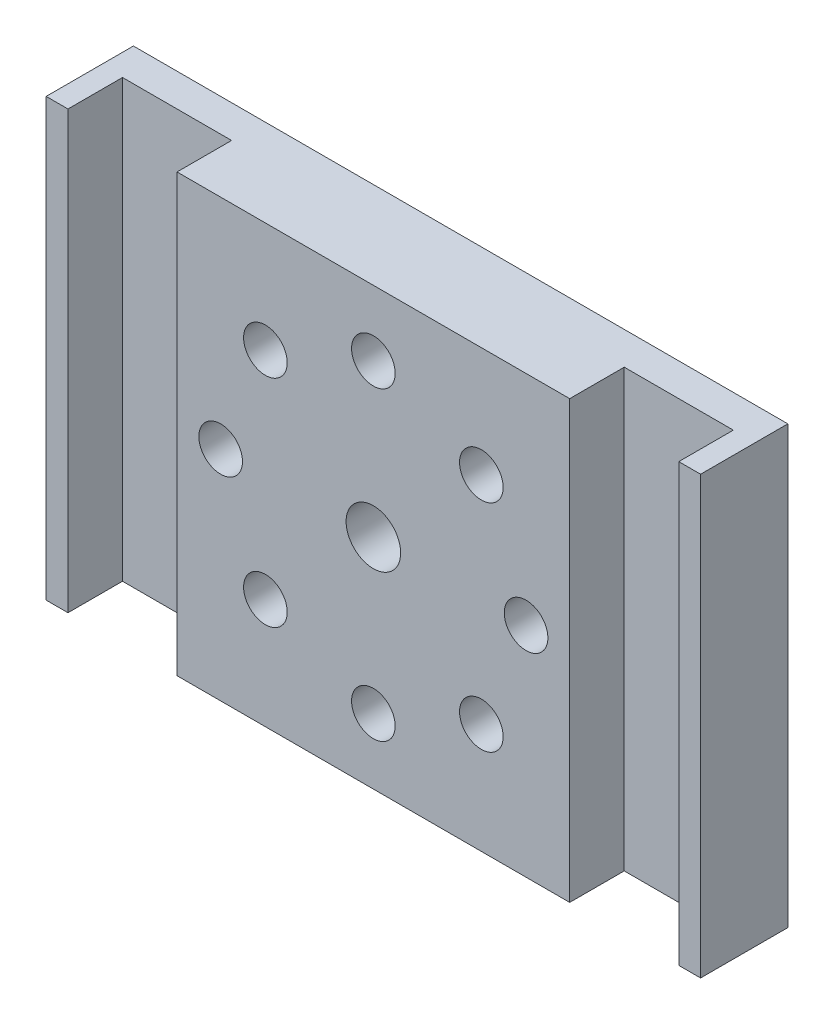
ISO-10303-21;
HEADER;
FILE_DESCRIPTION(('STEP AP214'),'2;1');
FILE_NAME('part.step','',(''),(''),'','','');
FILE_SCHEMA(('AUTOMOTIVE_DESIGN { 1 0 10303 214 1 1 1 1 }'));
ENDSEC;
DATA;
#1=APPLICATION_CONTEXT('core data for automotive mechanical design processes');
#2=APPLICATION_PROTOCOL_DEFINITION('international standard','automotive_design',2000,#1);
#3=PRODUCT_CONTEXT('',#1,'mechanical');
#4=PRODUCT('Part','Part','',(#3));
#5=PRODUCT_RELATED_PRODUCT_CATEGORY('part','',(#4));
#6=PRODUCT_DEFINITION_FORMATION('','',#4);
#7=PRODUCT_DEFINITION_CONTEXT('part definition',#1,'design');
#8=PRODUCT_DEFINITION('design','',#6,#7);
#9=PRODUCT_DEFINITION_SHAPE('','',#8);
#10=(LENGTH_UNIT() NAMED_UNIT(*) SI_UNIT(.MILLI.,.METRE.));
#11=(NAMED_UNIT(*) PLANE_ANGLE_UNIT() SI_UNIT($,.RADIAN.));
#12=(NAMED_UNIT(*) SI_UNIT($,.STERADIAN.) SOLID_ANGLE_UNIT());
#13=UNCERTAINTY_MEASURE_WITH_UNIT(LENGTH_MEASURE(1.E-05),#10,'distance_accuracy_value','');
#14=(GEOMETRIC_REPRESENTATION_CONTEXT(3) GLOBAL_UNCERTAINTY_ASSIGNED_CONTEXT((#13)) GLOBAL_UNIT_ASSIGNED_CONTEXT((#10,
#11,#12)) REPRESENTATION_CONTEXT('',''));
#15=CARTESIAN_POINT('',(0.,0.,0.));
#16=DIRECTION('',(0.,0.,1.));
#17=DIRECTION('',(1.,0.,0.));
#18=AXIS2_PLACEMENT_3D('',#15,#16,#17);
#19=CARTESIAN_POINT('',(-30.,-20.,8.));
#20=DIRECTION('',(0.,0.,-1.));
#21=DIRECTION('',(-1.,0.,0.));
#22=AXIS2_PLACEMENT_3D('',#19,#20,#21);
#23=PLANE('',#22);
#24=CARTESIAN_POINT('',(-13.9999999999998,-2.04602083981807E-13,8.));
#25=DIRECTION('',(0.,0.,1.));
#26=DIRECTION('',(1.,0.,0.));
#27=AXIS2_PLACEMENT_3D('',#24,#25,#26);
#28=CIRCLE('',#27,2.00000000000039);
#29=CARTESIAN_POINT('',(-11.9999999999994,-2.04602083981807E-13,8.));
#30=VERTEX_POINT('',#29);
#31=EDGE_CURVE('E254',#30,#30,#28,.T.);
#32=ORIENTED_EDGE('',*,*,#31,.F.);
#33=EDGE_LOOP('',(#32));
#34=FACE_BOUND('',#33,.T.);
#35=CARTESIAN_POINT('',(3.98903336916386E-13,-14.,8.));
#36=DIRECTION('',(0.,0.,1.));
#37=DIRECTION('',(1.,0.,0.));
#38=AXIS2_PLACEMENT_3D('',#35,#36,#37);
#39=CIRCLE('',#38,2.00000000000047);
#40=CARTESIAN_POINT('',(2.00000000000087,-14.,8.));
#41=VERTEX_POINT('',#40);
#42=EDGE_CURVE('E266',#41,#41,#39,.T.);
#43=ORIENTED_EDGE('',*,*,#42,.F.);
#44=EDGE_LOOP('',(#43));
#45=FACE_BOUND('',#44,.T.);
#46=CARTESIAN_POINT('',(14.,0.,8.));
#47=DIRECTION('',(0.,0.,1.));
#48=DIRECTION('',(1.,0.,0.));
#49=AXIS2_PLACEMENT_3D('',#46,#47,#48);
#50=CIRCLE('',#49,2.);
#51=CARTESIAN_POINT('',(16.,0.,8.));
#52=VERTEX_POINT('',#51);
#53=EDGE_CURVE('E278',#52,#52,#50,.T.);
#54=ORIENTED_EDGE('',*,*,#53,.F.);
#55=EDGE_LOOP('',(#54));
#56=FACE_BOUND('',#55,.T.);
#57=CARTESIAN_POINT('',(0.,14.,8.));
#58=DIRECTION('',(0.,0.,1.));
#59=DIRECTION('',(1.,0.,0.));
#60=AXIS2_PLACEMENT_3D('',#57,#58,#59);
#61=CIRCLE('',#60,2.);
#62=CARTESIAN_POINT('',(2.,14.,8.));
#63=VERTEX_POINT('',#62);
#64=EDGE_CURVE('E290',#63,#63,#61,.T.);
#65=ORIENTED_EDGE('',*,*,#64,.F.);
#66=EDGE_LOOP('',(#65));
#67=FACE_BOUND('',#66,.T.);
#68=CARTESIAN_POINT('',(0.,0.,8.));
#69=DIRECTION('',(0.,0.,1.));
#70=DIRECTION('',(1.,0.,0.));
#71=AXIS2_PLACEMENT_3D('',#68,#69,#70);
#72=CIRCLE('',#71,2.5);
#73=CARTESIAN_POINT('',(2.5,0.,8.));
#74=VERTEX_POINT('',#73);
#75=EDGE_CURVE('E156',#74,#74,#72,.T.);
#76=ORIENTED_EDGE('',*,*,#75,.F.);
#77=EDGE_LOOP('',(#76));
#78=FACE_BOUND('',#77,.T.);
#79=CARTESIAN_POINT('',(9.89949493661168,9.89949493661165,8.));
#80=DIRECTION('',(0.,0.,1.));
#81=DIRECTION('',(1.,0.,0.));
#82=AXIS2_PLACEMENT_3D('',#79,#80,#81);
#83=CIRCLE('',#82,2.);
#84=CARTESIAN_POINT('',(11.8994949366117,9.89949493661165,8.));
#85=VERTEX_POINT('',#84);
#86=EDGE_CURVE('E284',#85,#85,#83,.T.);
#87=ORIENTED_EDGE('',*,*,#86,.F.);
#88=EDGE_LOOP('',(#87));
#89=FACE_BOUND('',#88,.T.);
#90=CARTESIAN_POINT('',(9.899494936612,-9.89949493661153,8.));
#91=DIRECTION('',(0.,0.,1.));
#92=DIRECTION('',(1.,0.,0.));
#93=AXIS2_PLACEMENT_3D('',#90,#91,#92);
#94=CIRCLE('',#93,2.00000000000035);
#95=CARTESIAN_POINT('',(11.8994949366124,-9.89949493661153,8.));
#96=VERTEX_POINT('',#95);
#97=EDGE_CURVE('E272',#96,#96,#94,.T.);
#98=ORIENTED_EDGE('',*,*,#97,.F.);
#99=EDGE_LOOP('',(#98));
#100=FACE_BOUND('',#99,.T.);
#101=CARTESIAN_POINT('',(-9.89949493661133,-9.89949493661181,8.));
#102=DIRECTION('',(0.,0.,1.));
#103=DIRECTION('',(1.,0.,0.));
#104=AXIS2_PLACEMENT_3D('',#101,#102,#103);
#105=CIRCLE('',#104,2.00000000000049);
#106=CARTESIAN_POINT('',(-7.89949493661084,-9.89949493661181,8.));
#107=VERTEX_POINT('',#106);
#108=EDGE_CURVE('E260',#107,#107,#105,.T.);
#109=ORIENTED_EDGE('',*,*,#108,.F.);
#110=EDGE_LOOP('',(#109));
#111=FACE_BOUND('',#110,.T.);
#112=CARTESIAN_POINT('',(-9.89949493661154,9.89949493661179,8.));
#113=DIRECTION('',(0.,0.,1.));
#114=DIRECTION('',(1.,0.,0.));
#115=AXIS2_PLACEMENT_3D('',#112,#113,#114);
#116=CIRCLE('',#115,2.);
#117=CARTESIAN_POINT('',(-7.89949493661155,9.89949493661179,8.));
#118=VERTEX_POINT('',#117);
#119=EDGE_CURVE('E247',#118,#118,#116,.T.);
#120=ORIENTED_EDGE('',*,*,#119,.F.);
#121=EDGE_LOOP('',(#120));
#122=FACE_BOUND('',#121,.T.);
#123=DIRECTION('',(1.,0.,0.));
#124=VECTOR('',#123,1.);
#125=CARTESIAN_POINT('',(30.,-20.,8.));
#126=LINE('',#125,#124);
#127=CARTESIAN_POINT('',(-18.,-20.,8.));
#128=VERTEX_POINT('',#127);
#129=CARTESIAN_POINT('',(18.,-20.,8.));
#130=VERTEX_POINT('',#129);
#131=EDGE_CURVE('E139',#128,#130,#126,.T.);
#132=ORIENTED_EDGE('',*,*,#131,.T.);
#133=DIRECTION('',(0.,1.,0.));
#134=VECTOR('',#133,1.);
#135=CARTESIAN_POINT('',(18.,-20.,8.));
#136=LINE('',#135,#134);
#137=CARTESIAN_POINT('',(18.,20.,8.));
#138=VERTEX_POINT('',#137);
#139=EDGE_CURVE('E124',#130,#138,#136,.T.);
#140=ORIENTED_EDGE('',*,*,#139,.T.);
#141=DIRECTION('',(-1.,0.,0.));
#142=VECTOR('',#141,1.);
#143=CARTESIAN_POINT('',(-30.,20.,8.));
#144=LINE('',#143,#142);
#145=CARTESIAN_POINT('',(-18.,20.,8.));
#146=VERTEX_POINT('',#145);
#147=EDGE_CURVE('E164',#138,#146,#144,.T.);
#148=ORIENTED_EDGE('',*,*,#147,.T.);
#149=DIRECTION('',(0.,1.,0.));
#150=VECTOR('',#149,1.);
#151=CARTESIAN_POINT('',(-18.,-20.,8.));
#152=LINE('',#151,#150);
#153=EDGE_CURVE('E147',#128,#146,#152,.T.);
#154=ORIENTED_EDGE('',*,*,#153,.F.);
#155=EDGE_LOOP('',(#132,#140,#148,#154));
#156=FACE_BOUND('',#155,.T.);
#157=ADVANCED_FACE('F33',(#34,#45,#56,#67,#78,#89,#100,#111,#122,#156),#23,.F.);
#158=CARTESIAN_POINT('',(30.,20.,8.));
#159=VERTEX_POINT('',#158);
#160=CARTESIAN_POINT('',(28.,20.,8.));
#161=VERTEX_POINT('',#160);
#162=EDGE_CURVE('E160',#159,#161,#144,.T.);
#163=ORIENTED_EDGE('',*,*,#162,.T.);
#164=DIRECTION('',(0.,1.,0.));
#165=VECTOR('',#164,1.);
#166=CARTESIAN_POINT('',(28.,-20.,8.));
#167=LINE('',#166,#165);
#168=CARTESIAN_POINT('',(28.,-20.,8.));
#169=VERTEX_POINT('',#168);
#170=EDGE_CURVE('E49',#169,#161,#167,.T.);
#171=ORIENTED_EDGE('',*,*,#170,.F.);
#172=CARTESIAN_POINT('',(30.,-20.,8.));
#173=VERTEX_POINT('',#172);
#174=EDGE_CURVE('E149',#169,#173,#126,.T.);
#175=ORIENTED_EDGE('',*,*,#174,.T.);
#176=DIRECTION('',(0.,1.,0.));
#177=VECTOR('',#176,1.);
#178=CARTESIAN_POINT('',(30.,20.,8.));
#179=LINE('',#178,#177);
#180=EDGE_CURVE('E152',#173,#159,#179,.T.);
#181=ORIENTED_EDGE('',*,*,#180,.T.);
#182=EDGE_LOOP('',(#163,#171,#175,#181));
#183=FACE_BOUND('',#182,.T.);
#184=ADVANCED_FACE('F312',(#183),#23,.F.);
#185=CARTESIAN_POINT('',(-30.,-20.,0.));
#186=DIRECTION('',(0.,0.,-1.));
#187=DIRECTION('',(-1.,0.,0.));
#188=AXIS2_PLACEMENT_3D('',#185,#186,#187);
#189=PLANE('',#188);
#190=CARTESIAN_POINT('',(-9.89949493661154,9.89949493661179,0.));
#191=DIRECTION('',(0.,0.,1.));
#192=DIRECTION('',(1.,0.,0.));
#193=AXIS2_PLACEMENT_3D('',#190,#191,#192);
#194=CIRCLE('',#193,2.);
#195=CARTESIAN_POINT('',(-7.89949493661155,9.89949493661179,0.));
#196=VERTEX_POINT('',#195);
#197=EDGE_CURVE('E251',#196,#196,#194,.T.);
#198=ORIENTED_EDGE('',*,*,#197,.T.);
#199=EDGE_LOOP('',(#198));
#200=FACE_BOUND('',#199,.T.);
#201=CARTESIAN_POINT('',(-9.89949493661133,-9.89949493661181,0.));
#202=DIRECTION('',(0.,0.,1.));
#203=DIRECTION('',(1.,0.,0.));
#204=AXIS2_PLACEMENT_3D('',#201,#202,#203);
#205=CIRCLE('',#204,2.00000000000049);
#206=CARTESIAN_POINT('',(-7.89949493661084,-9.89949493661181,0.));
#207=VERTEX_POINT('',#206);
#208=EDGE_CURVE('E257',#207,#207,#205,.T.);
#209=ORIENTED_EDGE('',*,*,#208,.T.);
#210=EDGE_LOOP('',(#209));
#211=FACE_BOUND('',#210,.T.);
#212=CARTESIAN_POINT('',(9.899494936612,-9.89949493661153,0.));
#213=DIRECTION('',(0.,0.,1.));
#214=DIRECTION('',(1.,0.,0.));
#215=AXIS2_PLACEMENT_3D('',#212,#213,#214);
#216=CIRCLE('',#215,2.00000000000035);
#217=CARTESIAN_POINT('',(11.8994949366124,-9.89949493661153,0.));
#218=VERTEX_POINT('',#217);
#219=EDGE_CURVE('E269',#218,#218,#216,.T.);
#220=ORIENTED_EDGE('',*,*,#219,.T.);
#221=EDGE_LOOP('',(#220));
#222=FACE_BOUND('',#221,.T.);
#223=CARTESIAN_POINT('',(9.89949493661168,9.89949493661165,0.));
#224=DIRECTION('',(0.,0.,1.));
#225=DIRECTION('',(1.,0.,0.));
#226=AXIS2_PLACEMENT_3D('',#223,#224,#225);
#227=CIRCLE('',#226,2.);
#228=CARTESIAN_POINT('',(11.8994949366117,9.89949493661165,0.));
#229=VERTEX_POINT('',#228);
#230=EDGE_CURVE('E281',#229,#229,#227,.T.);
#231=ORIENTED_EDGE('',*,*,#230,.T.);
#232=EDGE_LOOP('',(#231));
#233=FACE_BOUND('',#232,.T.);
#234=DIRECTION('',(1.,0.,0.));
#235=VECTOR('',#234,1.);
#236=CARTESIAN_POINT('',(30.,-20.,0.));
#237=LINE('',#236,#235);
#238=CARTESIAN_POINT('',(-30.,-20.,0.));
#239=VERTEX_POINT('',#238);
#240=CARTESIAN_POINT('',(30.,-20.,0.));
#241=VERTEX_POINT('',#240);
#242=EDGE_CURVE('E167',#239,#241,#237,.T.);
#243=ORIENTED_EDGE('',*,*,#242,.F.);
#244=DIRECTION('',(0.,-1.,0.));
#245=VECTOR('',#244,1.);
#246=CARTESIAN_POINT('',(-30.,-20.,0.));
#247=LINE('',#246,#245);
#248=CARTESIAN_POINT('',(-30.,20.,0.));
#249=VERTEX_POINT('',#248);
#250=EDGE_CURVE('E153',#249,#239,#247,.T.);
#251=ORIENTED_EDGE('',*,*,#250,.F.);
#252=DIRECTION('',(-1.,0.,0.));
#253=VECTOR('',#252,1.);
#254=CARTESIAN_POINT('',(-30.,20.,0.));
#255=LINE('',#254,#253);
#256=CARTESIAN_POINT('',(30.,20.,0.));
#257=VERTEX_POINT('',#256);
#258=EDGE_CURVE('E172',#257,#249,#255,.T.);
#259=ORIENTED_EDGE('',*,*,#258,.F.);
#260=DIRECTION('',(0.,1.,0.));
#261=VECTOR('',#260,1.);
#262=CARTESIAN_POINT('',(30.,20.,0.));
#263=LINE('',#262,#261);
#264=EDGE_CURVE('E170',#241,#257,#263,.T.);
#265=ORIENTED_EDGE('',*,*,#264,.F.);
#266=EDGE_LOOP('',(#243,#251,#259,#265));
#267=FACE_BOUND('',#266,.T.);
#268=CARTESIAN_POINT('',(0.,14.,0.));
#269=DIRECTION('',(0.,0.,1.));
#270=DIRECTION('',(1.,0.,0.));
#271=AXIS2_PLACEMENT_3D('',#268,#269,#270);
#272=CIRCLE('',#271,2.);
#273=CARTESIAN_POINT('',(2.,14.,0.));
#274=VERTEX_POINT('',#273);
#275=EDGE_CURVE('E287',#274,#274,#272,.T.);
#276=ORIENTED_EDGE('',*,*,#275,.T.);
#277=EDGE_LOOP('',(#276));
#278=FACE_BOUND('',#277,.T.);
#279=CARTESIAN_POINT('',(14.,0.,0.));
#280=DIRECTION('',(0.,0.,1.));
#281=DIRECTION('',(1.,0.,0.));
#282=AXIS2_PLACEMENT_3D('',#279,#280,#281);
#283=CIRCLE('',#282,2.);
#284=CARTESIAN_POINT('',(16.,0.,0.));
#285=VERTEX_POINT('',#284);
#286=EDGE_CURVE('E275',#285,#285,#283,.T.);
#287=ORIENTED_EDGE('',*,*,#286,.T.);
#288=EDGE_LOOP('',(#287));
#289=FACE_BOUND('',#288,.T.);
#290=CARTESIAN_POINT('',(3.98903336916386E-13,-14.,0.));
#291=DIRECTION('',(0.,0.,1.));
#292=DIRECTION('',(1.,0.,0.));
#293=AXIS2_PLACEMENT_3D('',#290,#291,#292);
#294=CIRCLE('',#293,2.00000000000047);
#295=CARTESIAN_POINT('',(2.00000000000087,-14.,0.));
#296=VERTEX_POINT('',#295);
#297=EDGE_CURVE('E263',#296,#296,#294,.T.);
#298=ORIENTED_EDGE('',*,*,#297,.T.);
#299=EDGE_LOOP('',(#298));
#300=FACE_BOUND('',#299,.T.);
#301=CARTESIAN_POINT('',(-13.9999999999998,-2.04602083981807E-13,0.));
#302=DIRECTION('',(0.,0.,1.));
#303=DIRECTION('',(1.,0.,0.));
#304=AXIS2_PLACEMENT_3D('',#301,#302,#303);
#305=CIRCLE('',#304,2.00000000000039);
#306=CARTESIAN_POINT('',(-11.9999999999994,-2.04602083981807E-13,0.));
#307=VERTEX_POINT('',#306);
#308=EDGE_CURVE('E250',#307,#307,#305,.T.);
#309=ORIENTED_EDGE('',*,*,#308,.T.);
#310=EDGE_LOOP('',(#309));
#311=FACE_BOUND('',#310,.T.);
#312=CARTESIAN_POINT('',(0.,0.,0.));
#313=DIRECTION('',(0.,0.,1.));
#314=DIRECTION('',(1.,0.,0.));
#315=AXIS2_PLACEMENT_3D('',#312,#313,#314);
#316=CIRCLE('',#315,4.);
#317=CARTESIAN_POINT('',(4.,0.,0.));
#318=VERTEX_POINT('',#317);
#319=EDGE_CURVE('E239',#318,#318,#316,.T.);
#320=ORIENTED_EDGE('',*,*,#319,.T.);
#321=EDGE_LOOP('',(#320));
#322=FACE_BOUND('',#321,.T.);
#323=ADVANCED_FACE('F192',(#200,#211,#222,#233,#267,#278,#289,#300,#311,#322),#189,.T.);
#324=CARTESIAN_POINT('',(-30.,-20.,8.));
#325=VERTEX_POINT('',#324);
#326=CARTESIAN_POINT('',(-28.,-20.,8.));
#327=VERTEX_POINT('',#326);
#328=EDGE_CURVE('E148',#325,#327,#126,.T.);
#329=ORIENTED_EDGE('',*,*,#328,.T.);
#330=DIRECTION('',(0.,1.,0.));
#331=VECTOR('',#330,1.);
#332=CARTESIAN_POINT('',(-28.,-20.,8.));
#333=LINE('',#332,#331);
#334=CARTESIAN_POINT('',(-28.,20.,8.));
#335=VERTEX_POINT('',#334);
#336=EDGE_CURVE('E207',#327,#335,#333,.T.);
#337=ORIENTED_EDGE('',*,*,#336,.T.);
#338=CARTESIAN_POINT('',(-30.,20.,8.));
#339=VERTEX_POINT('',#338);
#340=EDGE_CURVE('E159',#335,#339,#144,.T.);
#341=ORIENTED_EDGE('',*,*,#340,.T.);
#342=DIRECTION('',(0.,-1.,0.));
#343=VECTOR('',#342,1.);
#344=CARTESIAN_POINT('',(-30.,-20.,8.));
#345=LINE('',#344,#343);
#346=EDGE_CURVE('E163',#339,#325,#345,.T.);
#347=ORIENTED_EDGE('',*,*,#346,.T.);
#348=EDGE_LOOP('',(#329,#337,#341,#347));
#349=FACE_BOUND('',#348,.T.);
#350=ADVANCED_FACE('F206',(#349),#23,.F.);
#351=CARTESIAN_POINT('',(30.,-20.,8.));
#352=DIRECTION('',(0.,1.,0.));
#353=DIRECTION('',(-1.,0.,0.));
#354=AXIS2_PLACEMENT_3D('',#351,#352,#353);
#355=PLANE('',#354);
#356=CARTESIAN_POINT('',(15.5,-20.,4.));
#357=DIRECTION('',(0.,-1.,0.));
#358=DIRECTION('',(1.,0.,0.));
#359=AXIS2_PLACEMENT_3D('',#356,#357,#358);
#360=CIRCLE('',#359,2.);
#361=CARTESIAN_POINT('',(17.5,-20.,4.));
#362=VERTEX_POINT('',#361);
#363=EDGE_CURVE('E225',#362,#362,#360,.T.);
#364=ORIENTED_EDGE('',*,*,#363,.F.);
#365=EDGE_LOOP('',(#364));
#366=FACE_BOUND('',#365,.T.);
#367=CARTESIAN_POINT('',(-15.5,-20.,4.));
#368=DIRECTION('',(0.,-1.,0.));
#369=DIRECTION('',(1.,0.,0.));
#370=AXIS2_PLACEMENT_3D('',#367,#368,#369);
#371=CIRCLE('',#370,2.);
#372=CARTESIAN_POINT('',(-13.5,-20.,4.));
#373=VERTEX_POINT('',#372);
#374=EDGE_CURVE('E233',#373,#373,#371,.T.);
#375=ORIENTED_EDGE('',*,*,#374,.F.);
#376=EDGE_LOOP('',(#375));
#377=FACE_BOUND('',#376,.T.);
#378=DIRECTION('',(-1.,0.,0.));
#379=VECTOR('',#378,1.);
#380=CARTESIAN_POINT('',(28.,-20.,3.));
#381=LINE('',#380,#379);
#382=CARTESIAN_POINT('',(28.,-20.,3.));
#383=VERTEX_POINT('',#382);
#384=CARTESIAN_POINT('',(18.,-20.,3.));
#385=VERTEX_POINT('',#384);
#386=EDGE_CURVE('E134',#383,#385,#381,.T.);
#387=ORIENTED_EDGE('',*,*,#386,.T.);
#388=DIRECTION('',(0.,0.,1.));
#389=VECTOR('',#388,1.);
#390=CARTESIAN_POINT('',(18.,-20.,3.));
#391=LINE('',#390,#389);
#392=EDGE_CURVE('E127',#385,#130,#391,.T.);
#393=ORIENTED_EDGE('',*,*,#392,.T.);
#394=ORIENTED_EDGE('',*,*,#131,.F.);
#395=DIRECTION('',(0.,0.,-1.));
#396=VECTOR('',#395,1.);
#397=CARTESIAN_POINT('',(-18.,-20.,3.));
#398=LINE('',#397,#396);
#399=CARTESIAN_POINT('',(-18.,-20.,3.));
#400=VERTEX_POINT('',#399);
#401=EDGE_CURVE('E215',#128,#400,#398,.T.);
#402=ORIENTED_EDGE('',*,*,#401,.T.);
#403=DIRECTION('',(-1.,0.,0.));
#404=VECTOR('',#403,1.);
#405=CARTESIAN_POINT('',(-28.,-20.,3.));
#406=LINE('',#405,#404);
#407=CARTESIAN_POINT('',(-28.,-20.,3.));
#408=VERTEX_POINT('',#407);
#409=EDGE_CURVE('E218',#400,#408,#406,.T.);
#410=ORIENTED_EDGE('',*,*,#409,.T.);
#411=DIRECTION('',(0.,0.,1.));
#412=VECTOR('',#411,1.);
#413=CARTESIAN_POINT('',(-28.,-20.,8.));
#414=LINE('',#413,#412);
#415=EDGE_CURVE('E203',#408,#327,#414,.T.);
#416=ORIENTED_EDGE('',*,*,#415,.T.);
#417=ORIENTED_EDGE('',*,*,#328,.F.);
#418=DIRECTION('',(0.,0.,-1.));
#419=VECTOR('',#418,1.);
#420=CARTESIAN_POINT('',(-30.,-20.,8.));
#421=LINE('',#420,#419);
#422=EDGE_CURVE('E166',#325,#239,#421,.T.);
#423=ORIENTED_EDGE('',*,*,#422,.T.);
#424=ORIENTED_EDGE('',*,*,#242,.T.);
#425=DIRECTION('',(0.,0.,-1.));
#426=VECTOR('',#425,1.);
#427=CARTESIAN_POINT('',(30.,-20.,8.));
#428=LINE('',#427,#426);
#429=EDGE_CURVE('E11',#173,#241,#428,.T.);
#430=ORIENTED_EDGE('',*,*,#429,.F.);
#431=ORIENTED_EDGE('',*,*,#174,.F.);
#432=DIRECTION('',(0.,0.,-1.));
#433=VECTOR('',#432,1.);
#434=CARTESIAN_POINT('',(28.,-20.,8.));
#435=LINE('',#434,#433);
#436=EDGE_CURVE('E142',#169,#383,#435,.T.);
#437=ORIENTED_EDGE('',*,*,#436,.T.);
#438=EDGE_LOOP('',(#387,#393,#394,#402,#410,#416,#417,#423,#424,#430,#431,#437));
#439=FACE_BOUND('',#438,.T.);
#440=ADVANCED_FACE('F35',(#366,#377,#439),#355,.F.);
#441=CARTESIAN_POINT('',(30.,20.,8.));
#442=DIRECTION('',(-1.,0.,0.));
#443=DIRECTION('',(0.,-1.,0.));
#444=AXIS2_PLACEMENT_3D('',#441,#442,#443);
#445=PLANE('',#444);
#446=ORIENTED_EDGE('',*,*,#264,.T.);
#447=DIRECTION('',(0.,0.,-1.));
#448=VECTOR('',#447,1.);
#449=CARTESIAN_POINT('',(30.,20.,8.));
#450=LINE('',#449,#448);
#451=EDGE_CURVE('E42',#159,#257,#450,.T.);
#452=ORIENTED_EDGE('',*,*,#451,.F.);
#453=ORIENTED_EDGE('',*,*,#180,.F.);
#454=ORIENTED_EDGE('',*,*,#429,.T.);
#455=EDGE_LOOP('',(#446,#452,#453,#454));
#456=FACE_BOUND('',#455,.T.);
#457=ADVANCED_FACE('F327',(#456),#445,.F.);
#458=CARTESIAN_POINT('',(-30.,20.,8.));
#459=DIRECTION('',(0.,-1.,0.));
#460=DIRECTION('',(1.,0.,0.));
#461=AXIS2_PLACEMENT_3D('',#458,#459,#460);
#462=PLANE('',#461);
#463=ORIENTED_EDGE('',*,*,#147,.F.);
#464=DIRECTION('',(0.,0.,1.));
#465=VECTOR('',#464,1.);
#466=CARTESIAN_POINT('',(18.,20.,3.));
#467=LINE('',#466,#465);
#468=CARTESIAN_POINT('',(18.,20.,3.));
#469=VERTEX_POINT('',#468);
#470=EDGE_CURVE('E130',#469,#138,#467,.T.);
#471=ORIENTED_EDGE('',*,*,#470,.F.);
#472=DIRECTION('',(-1.,0.,0.));
#473=VECTOR('',#472,1.);
#474=CARTESIAN_POINT('',(28.,20.,3.));
#475=LINE('',#474,#473);
#476=CARTESIAN_POINT('',(28.,20.,3.));
#477=VERTEX_POINT('',#476);
#478=EDGE_CURVE('E143',#477,#469,#475,.T.);
#479=ORIENTED_EDGE('',*,*,#478,.F.);
#480=DIRECTION('',(0.,0.,-1.));
#481=VECTOR('',#480,1.);
#482=CARTESIAN_POINT('',(28.,20.,8.));
#483=LINE('',#482,#481);
#484=EDGE_CURVE('E351',#161,#477,#483,.T.);
#485=ORIENTED_EDGE('',*,*,#484,.F.);
#486=ORIENTED_EDGE('',*,*,#162,.F.);
#487=ORIENTED_EDGE('',*,*,#451,.T.);
#488=ORIENTED_EDGE('',*,*,#258,.T.);
#489=DIRECTION('',(0.,0.,-1.));
#490=VECTOR('',#489,1.);
#491=CARTESIAN_POINT('',(-30.,20.,8.));
#492=LINE('',#491,#490);
#493=EDGE_CURVE('E177',#339,#249,#492,.T.);
#494=ORIENTED_EDGE('',*,*,#493,.F.);
#495=ORIENTED_EDGE('',*,*,#340,.F.);
#496=DIRECTION('',(0.,0.,1.));
#497=VECTOR('',#496,1.);
#498=CARTESIAN_POINT('',(-28.,20.,8.));
#499=LINE('',#498,#497);
#500=CARTESIAN_POINT('',(-28.,20.,3.));
#501=VERTEX_POINT('',#500);
#502=EDGE_CURVE('E219',#501,#335,#499,.T.);
#503=ORIENTED_EDGE('',*,*,#502,.F.);
#504=DIRECTION('',(-1.,0.,0.));
#505=VECTOR('',#504,1.);
#506=CARTESIAN_POINT('',(-28.,20.,3.));
#507=LINE('',#506,#505);
#508=CARTESIAN_POINT('',(-18.,20.,3.));
#509=VERTEX_POINT('',#508);
#510=EDGE_CURVE('E57',#509,#501,#507,.T.);
#511=ORIENTED_EDGE('',*,*,#510,.F.);
#512=DIRECTION('',(0.,0.,-1.));
#513=VECTOR('',#512,1.);
#514=CARTESIAN_POINT('',(-18.,20.,3.));
#515=LINE('',#514,#513);
#516=EDGE_CURVE('E214',#146,#509,#515,.T.);
#517=ORIENTED_EDGE('',*,*,#516,.F.);
#518=EDGE_LOOP('',(#463,#471,#479,#485,#486,#487,#488,#494,#495,#503,#511,#517));
#519=FACE_BOUND('',#518,.T.);
#520=ADVANCED_FACE('F185',(#519),#462,.F.);
#521=CARTESIAN_POINT('',(-30.,-20.,8.));
#522=DIRECTION('',(1.,0.,0.));
#523=DIRECTION('',(0.,1.,0.));
#524=AXIS2_PLACEMENT_3D('',#521,#522,#523);
#525=PLANE('',#524);
#526=ORIENTED_EDGE('',*,*,#250,.T.);
#527=ORIENTED_EDGE('',*,*,#422,.F.);
#528=ORIENTED_EDGE('',*,*,#346,.F.);
#529=ORIENTED_EDGE('',*,*,#493,.T.);
#530=EDGE_LOOP('',(#526,#527,#528,#529));
#531=FACE_BOUND('',#530,.T.);
#532=ADVANCED_FACE('F196',(#531),#525,.F.);
#533=CARTESIAN_POINT('',(0.,0.,8.));
#534=DIRECTION('',(0.,0.,-1.));
#535=DIRECTION('',(-1.,0.,0.));
#536=AXIS2_PLACEMENT_3D('',#533,#534,#535);
#537=CYLINDRICAL_SURFACE('',#536,2.5);
#538=CARTESIAN_POINT('',(0.,0.,4.));
#539=DIRECTION('',(0.,0.,1.));
#540=DIRECTION('',(1.,0.,0.));
#541=AXIS2_PLACEMENT_3D('',#538,#539,#540);
#542=CIRCLE('',#541,2.5);
#543=CARTESIAN_POINT('',(2.5,0.,4.));
#544=VERTEX_POINT('',#543);
#545=EDGE_CURVE('E37',#544,#544,#542,.T.);
#546=ORIENTED_EDGE('',*,*,#545,.F.);
#547=EDGE_LOOP('',(#546));
#548=FACE_BOUND('',#547,.T.);
#549=ORIENTED_EDGE('',*,*,#75,.T.);
#550=EDGE_LOOP('',(#549));
#551=FACE_BOUND('',#550,.T.);
#552=ADVANCED_FACE('F299',(#548,#551),#537,.F.);
#553=CARTESIAN_POINT('',(0.,14.,8.));
#554=DIRECTION('',(0.,0.,-1.));
#555=DIRECTION('',(-1.,0.,0.));
#556=AXIS2_PLACEMENT_3D('',#553,#554,#555);
#557=CYLINDRICAL_SURFACE('',#556,2.);
#558=ORIENTED_EDGE('',*,*,#64,.T.);
#559=EDGE_LOOP('',(#558));
#560=FACE_BOUND('',#559,.T.);
#561=ORIENTED_EDGE('',*,*,#275,.F.);
#562=EDGE_LOOP('',(#561));
#563=FACE_BOUND('',#562,.T.);
#564=ADVANCED_FACE('F296',(#560,#563),#557,.F.);
#565=CARTESIAN_POINT('',(9.89949493661168,9.89949493661165,8.));
#566=DIRECTION('',(0.,0.,-1.));
#567=DIRECTION('',(-1.,0.,0.));
#568=AXIS2_PLACEMENT_3D('',#565,#566,#567);
#569=CYLINDRICAL_SURFACE('',#568,2.);
#570=ORIENTED_EDGE('',*,*,#86,.T.);
#571=EDGE_LOOP('',(#570));
#572=FACE_BOUND('',#571,.T.);
#573=ORIENTED_EDGE('',*,*,#230,.F.);
#574=EDGE_LOOP('',(#573));
#575=FACE_BOUND('',#574,.T.);
#576=ADVANCED_FACE('F298',(#572,#575),#569,.F.);
#577=CARTESIAN_POINT('',(14.,0.,8.));
#578=DIRECTION('',(0.,0.,-1.));
#579=DIRECTION('',(-1.,0.,0.));
#580=AXIS2_PLACEMENT_3D('',#577,#578,#579);
#581=CYLINDRICAL_SURFACE('',#580,2.);
#582=ORIENTED_EDGE('',*,*,#53,.T.);
#583=EDGE_LOOP('',(#582));
#584=FACE_BOUND('',#583,.T.);
#585=ORIENTED_EDGE('',*,*,#286,.F.);
#586=EDGE_LOOP('',(#585));
#587=FACE_BOUND('',#586,.T.);
#588=ADVANCED_FACE('F306',(#584,#587),#581,.F.);
#589=CARTESIAN_POINT('',(9.899494936612,-9.89949493661153,8.));
#590=DIRECTION('',(0.,0.,-1.));
#591=DIRECTION('',(-1.,0.,0.));
#592=AXIS2_PLACEMENT_3D('',#589,#590,#591);
#593=CYLINDRICAL_SURFACE('',#592,2.00000000000035);
#594=ORIENTED_EDGE('',*,*,#97,.T.);
#595=EDGE_LOOP('',(#594));
#596=FACE_BOUND('',#595,.T.);
#597=ORIENTED_EDGE('',*,*,#219,.F.);
#598=EDGE_LOOP('',(#597));
#599=FACE_BOUND('',#598,.T.);
#600=ADVANCED_FACE('F416',(#596,#599),#593,.F.);
#601=CARTESIAN_POINT('',(3.98903336916386E-13,-14.,8.));
#602=DIRECTION('',(0.,0.,-1.));
#603=DIRECTION('',(-1.,0.,0.));
#604=AXIS2_PLACEMENT_3D('',#601,#602,#603);
#605=CYLINDRICAL_SURFACE('',#604,2.00000000000047);
#606=ORIENTED_EDGE('',*,*,#42,.T.);
#607=EDGE_LOOP('',(#606));
#608=FACE_BOUND('',#607,.T.);
#609=ORIENTED_EDGE('',*,*,#297,.F.);
#610=EDGE_LOOP('',(#609));
#611=FACE_BOUND('',#610,.T.);
#612=ADVANCED_FACE('F412',(#608,#611),#605,.F.);
#613=CARTESIAN_POINT('',(-9.89949493661133,-9.89949493661181,8.));
#614=DIRECTION('',(0.,0.,-1.));
#615=DIRECTION('',(-1.,0.,0.));
#616=AXIS2_PLACEMENT_3D('',#613,#614,#615);
#617=CYLINDRICAL_SURFACE('',#616,2.00000000000049);
#618=ORIENTED_EDGE('',*,*,#108,.T.);
#619=EDGE_LOOP('',(#618));
#620=FACE_BOUND('',#619,.T.);
#621=ORIENTED_EDGE('',*,*,#208,.F.);
#622=EDGE_LOOP('',(#621));
#623=FACE_BOUND('',#622,.T.);
#624=ADVANCED_FACE('F408',(#620,#623),#617,.F.);
#625=CARTESIAN_POINT('',(-13.9999999999998,-2.04602083981807E-13,8.));
#626=DIRECTION('',(0.,0.,-1.));
#627=DIRECTION('',(-1.,0.,0.));
#628=AXIS2_PLACEMENT_3D('',#625,#626,#627);
#629=CYLINDRICAL_SURFACE('',#628,2.00000000000039);
#630=ORIENTED_EDGE('',*,*,#31,.T.);
#631=EDGE_LOOP('',(#630));
#632=FACE_BOUND('',#631,.T.);
#633=ORIENTED_EDGE('',*,*,#308,.F.);
#634=EDGE_LOOP('',(#633));
#635=FACE_BOUND('',#634,.T.);
#636=ADVANCED_FACE('F404',(#632,#635),#629,.F.);
#637=CARTESIAN_POINT('',(-9.89949493661154,9.89949493661179,8.));
#638=DIRECTION('',(0.,0.,-1.));
#639=DIRECTION('',(-1.,0.,0.));
#640=AXIS2_PLACEMENT_3D('',#637,#638,#639);
#641=CYLINDRICAL_SURFACE('',#640,2.);
#642=ORIENTED_EDGE('',*,*,#119,.T.);
#643=EDGE_LOOP('',(#642));
#644=FACE_BOUND('',#643,.T.);
#645=ORIENTED_EDGE('',*,*,#197,.F.);
#646=EDGE_LOOP('',(#645));
#647=FACE_BOUND('',#646,.T.);
#648=ADVANCED_FACE('F400',(#644,#647),#641,.F.);
#649=CARTESIAN_POINT('',(0.,0.,4.));
#650=DIRECTION('',(0.,0.,-1.));
#651=DIRECTION('',(-1.,0.,0.));
#652=AXIS2_PLACEMENT_3D('',#649,#650,#651);
#653=CYLINDRICAL_SURFACE('',#652,4.);
#654=CARTESIAN_POINT('',(0.,0.,4.));
#655=DIRECTION('',(0.,0.,1.));
#656=DIRECTION('',(1.,0.,0.));
#657=AXIS2_PLACEMENT_3D('',#654,#655,#656);
#658=CIRCLE('',#657,4.);
#659=CARTESIAN_POINT('',(4.,0.,4.));
#660=VERTEX_POINT('',#659);
#661=EDGE_CURVE('E242',#660,#660,#658,.T.);
#662=ORIENTED_EDGE('',*,*,#661,.T.);
#663=EDGE_LOOP('',(#662));
#664=FACE_BOUND('',#663,.T.);
#665=ORIENTED_EDGE('',*,*,#319,.F.);
#666=EDGE_LOOP('',(#665));
#667=FACE_BOUND('',#666,.T.);
#668=ADVANCED_FACE('F396',(#664,#667),#653,.F.);
#669=CARTESIAN_POINT('',(0.,0.,4.));
#670=DIRECTION('',(0.,0.,1.));
#671=DIRECTION('',(1.,0.,0.));
#672=AXIS2_PLACEMENT_3D('',#669,#670,#671);
#673=PLANE('',#672);
#674=ORIENTED_EDGE('',*,*,#545,.T.);
#675=EDGE_LOOP('',(#674));
#676=FACE_BOUND('',#675,.T.);
#677=ORIENTED_EDGE('',*,*,#661,.F.);
#678=EDGE_LOOP('',(#677));
#679=FACE_BOUND('',#678,.T.);
#680=ADVANCED_FACE('F392',(#676,#679),#673,.F.);
#681=CARTESIAN_POINT('',(-15.5,-5.,4.));
#682=DIRECTION('',(0.,-1.,0.));
#683=DIRECTION('',(1.,0.,0.));
#684=AXIS2_PLACEMENT_3D('',#681,#682,#683);
#685=CYLINDRICAL_SURFACE('',#684,2.);
#686=CARTESIAN_POINT('',(-15.5,-5.,4.));
#687=DIRECTION('',(0.,-1.,0.));
#688=DIRECTION('',(1.,0.,0.));
#689=AXIS2_PLACEMENT_3D('',#686,#687,#688);
#690=CIRCLE('',#689,2.);
#691=CARTESIAN_POINT('',(-13.5,-5.,4.));
#692=VERTEX_POINT('',#691);
#693=EDGE_CURVE('E236',#692,#692,#690,.T.);
#694=ORIENTED_EDGE('',*,*,#693,.F.);
#695=EDGE_LOOP('',(#694));
#696=FACE_BOUND('',#695,.T.);
#697=ORIENTED_EDGE('',*,*,#374,.T.);
#698=EDGE_LOOP('',(#697));
#699=FACE_BOUND('',#698,.T.);
#700=ADVANCED_FACE('F388',(#696,#699),#685,.F.);
#701=CARTESIAN_POINT('',(-15.5,-5.,4.));
#702=DIRECTION('',(0.,-1.,0.));
#703=DIRECTION('',(1.,0.,0.));
#704=AXIS2_PLACEMENT_3D('',#701,#702,#703);
#705=PLANE('',#704);
#706=ORIENTED_EDGE('',*,*,#693,.T.);
#707=EDGE_LOOP('',(#706));
#708=FACE_BOUND('',#707,.T.);
#709=ADVANCED_FACE('F384',(#708),#705,.T.);
#710=CARTESIAN_POINT('',(15.5,-5.,4.));
#711=DIRECTION('',(0.,-1.,0.));
#712=DIRECTION('',(1.,0.,0.));
#713=AXIS2_PLACEMENT_3D('',#710,#711,#712);
#714=CYLINDRICAL_SURFACE('',#713,2.);
#715=CARTESIAN_POINT('',(15.5,-5.,4.));
#716=DIRECTION('',(0.,-1.,0.));
#717=DIRECTION('',(1.,0.,0.));
#718=AXIS2_PLACEMENT_3D('',#715,#716,#717);
#719=CIRCLE('',#718,2.);
#720=CARTESIAN_POINT('',(17.5,-5.,4.));
#721=VERTEX_POINT('',#720);
#722=EDGE_CURVE('E230',#721,#721,#719,.T.);
#723=ORIENTED_EDGE('',*,*,#722,.F.);
#724=EDGE_LOOP('',(#723));
#725=FACE_BOUND('',#724,.T.);
#726=ORIENTED_EDGE('',*,*,#363,.T.);
#727=EDGE_LOOP('',(#726));
#728=FACE_BOUND('',#727,.T.);
#729=ADVANCED_FACE('F380',(#725,#728),#714,.F.);
#730=CARTESIAN_POINT('',(15.5,-5.,4.));
#731=DIRECTION('',(0.,-1.,0.));
#732=DIRECTION('',(1.,0.,0.));
#733=AXIS2_PLACEMENT_3D('',#730,#731,#732);
#734=PLANE('',#733);
#735=ORIENTED_EDGE('',*,*,#722,.T.);
#736=EDGE_LOOP('',(#735));
#737=FACE_BOUND('',#736,.T.);
#738=ADVANCED_FACE('F377',(#737),#734,.T.);
#739=CARTESIAN_POINT('',(-28.,-20.,3.));
#740=DIRECTION('',(0.,0.,-1.));
#741=DIRECTION('',(-1.,0.,0.));
#742=AXIS2_PLACEMENT_3D('',#739,#740,#741);
#743=PLANE('',#742);
#744=ORIENTED_EDGE('',*,*,#510,.T.);
#745=DIRECTION('',(0.,1.,0.));
#746=VECTOR('',#745,1.);
#747=CARTESIAN_POINT('',(-28.,-20.,3.));
#748=LINE('',#747,#746);
#749=EDGE_CURVE('E228',#408,#501,#748,.T.);
#750=ORIENTED_EDGE('',*,*,#749,.F.);
#751=ORIENTED_EDGE('',*,*,#409,.F.);
#752=DIRECTION('',(0.,1.,0.));
#753=VECTOR('',#752,1.);
#754=CARTESIAN_POINT('',(-18.,-20.,3.));
#755=LINE('',#754,#753);
#756=EDGE_CURVE('E216',#400,#509,#755,.T.);
#757=ORIENTED_EDGE('',*,*,#756,.T.);
#758=EDGE_LOOP('',(#744,#750,#751,#757));
#759=FACE_BOUND('',#758,.T.);
#760=ADVANCED_FACE('F371',(#759),#743,.F.);
#761=CARTESIAN_POINT('',(-18.,-20.,3.));
#762=DIRECTION('',(1.,0.,0.));
#763=DIRECTION('',(0.,1.,0.));
#764=AXIS2_PLACEMENT_3D('',#761,#762,#763);
#765=PLANE('',#764);
#766=ORIENTED_EDGE('',*,*,#516,.T.);
#767=ORIENTED_EDGE('',*,*,#756,.F.);
#768=ORIENTED_EDGE('',*,*,#401,.F.);
#769=ORIENTED_EDGE('',*,*,#153,.T.);
#770=EDGE_LOOP('',(#766,#767,#768,#769));
#771=FACE_BOUND('',#770,.T.);
#772=ADVANCED_FACE('F213',(#771),#765,.F.);
#773=CARTESIAN_POINT('',(-28.,-20.,8.));
#774=DIRECTION('',(-1.,0.,0.));
#775=DIRECTION('',(0.,-1.,0.));
#776=AXIS2_PLACEMENT_3D('',#773,#774,#775);
#777=PLANE('',#776);
#778=ORIENTED_EDGE('',*,*,#502,.T.);
#779=ORIENTED_EDGE('',*,*,#336,.F.);
#780=ORIENTED_EDGE('',*,*,#415,.F.);
#781=ORIENTED_EDGE('',*,*,#749,.T.);
#782=EDGE_LOOP('',(#778,#779,#780,#781));
#783=FACE_BOUND('',#782,.T.);
#784=ADVANCED_FACE('F366',(#783),#777,.F.);
#785=CARTESIAN_POINT('',(18.,-20.,3.));
#786=DIRECTION('',(-1.,0.,0.));
#787=DIRECTION('',(0.,-1.,0.));
#788=AXIS2_PLACEMENT_3D('',#785,#786,#787);
#789=PLANE('',#788);
#790=ORIENTED_EDGE('',*,*,#470,.T.);
#791=ORIENTED_EDGE('',*,*,#139,.F.);
#792=ORIENTED_EDGE('',*,*,#392,.F.);
#793=DIRECTION('',(0.,1.,0.));
#794=VECTOR('',#793,1.);
#795=CARTESIAN_POINT('',(18.,-20.,3.));
#796=LINE('',#795,#794);
#797=EDGE_CURVE('E343',#385,#469,#796,.T.);
#798=ORIENTED_EDGE('',*,*,#797,.T.);
#799=EDGE_LOOP('',(#790,#791,#792,#798));
#800=FACE_BOUND('',#799,.T.);
#801=ADVANCED_FACE('F126',(#800),#789,.F.);
#802=CARTESIAN_POINT('',(28.,-20.,3.));
#803=DIRECTION('',(0.,0.,-1.));
#804=DIRECTION('',(-1.,0.,0.));
#805=AXIS2_PLACEMENT_3D('',#802,#803,#804);
#806=PLANE('',#805);
#807=ORIENTED_EDGE('',*,*,#478,.T.);
#808=ORIENTED_EDGE('',*,*,#797,.F.);
#809=ORIENTED_EDGE('',*,*,#386,.F.);
#810=DIRECTION('',(0.,1.,0.));
#811=VECTOR('',#810,1.);
#812=CARTESIAN_POINT('',(28.,-20.,3.));
#813=LINE('',#812,#811);
#814=EDGE_CURVE('E341',#383,#477,#813,.T.);
#815=ORIENTED_EDGE('',*,*,#814,.T.);
#816=EDGE_LOOP('',(#807,#808,#809,#815));
#817=FACE_BOUND('',#816,.T.);
#818=ADVANCED_FACE('F358',(#817),#806,.F.);
#819=CARTESIAN_POINT('',(28.,-20.,8.));
#820=DIRECTION('',(1.,0.,0.));
#821=DIRECTION('',(0.,1.,0.));
#822=AXIS2_PLACEMENT_3D('',#819,#820,#821);
#823=PLANE('',#822);
#824=ORIENTED_EDGE('',*,*,#484,.T.);
#825=ORIENTED_EDGE('',*,*,#814,.F.);
#826=ORIENTED_EDGE('',*,*,#436,.F.);
#827=ORIENTED_EDGE('',*,*,#170,.T.);
#828=EDGE_LOOP('',(#824,#825,#826,#827));
#829=FACE_BOUND('',#828,.T.);
#830=ADVANCED_FACE('F356',(#829),#823,.F.);
#831=CLOSED_SHELL('',(#157,#184,#323,#350,#440,#457,#520,#532,#552,#564,#576,#588,#600,#612,
#624,#636,#648,#668,#680,#700,#709,#729,#738,#760,#772,#784,#801,#818,#830));
#832=MANIFOLD_SOLID_BREP('B2',#831);
#833=ADVANCED_BREP_SHAPE_REPRESENTATION('',(#18,#832),#14);
#834=SHAPE_DEFINITION_REPRESENTATION(#9,#833);
ENDSEC;
END-ISO-10303-21;
